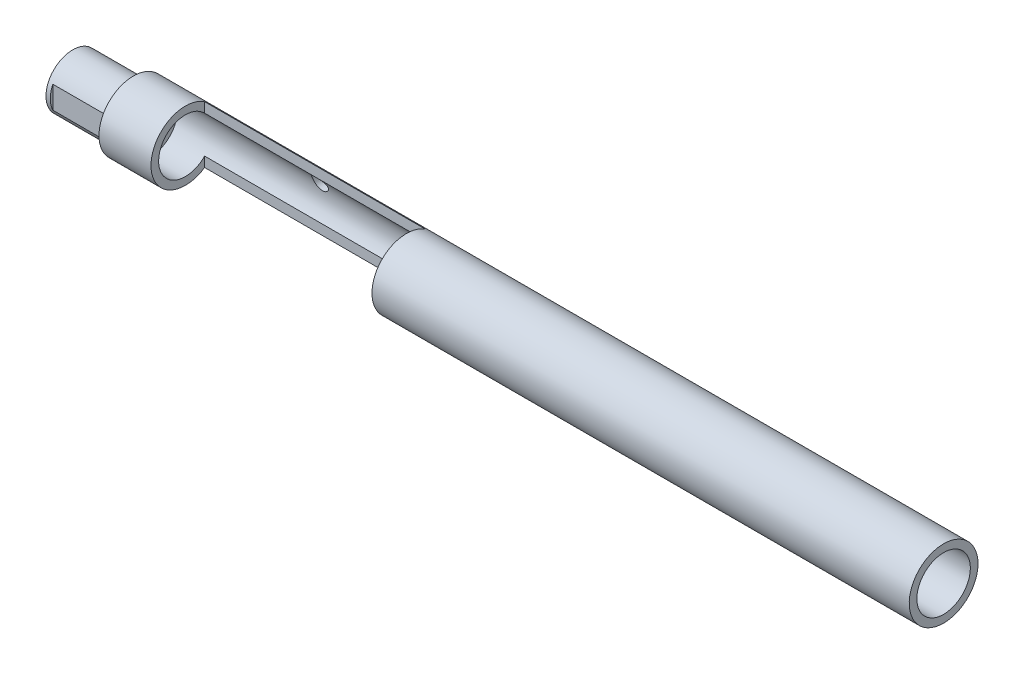
ISO-10303-21;
HEADER;
FILE_DESCRIPTION(('STEP AP214'),'2;1');
FILE_NAME('part.step','',(''),(''),'','','');
FILE_SCHEMA(('AUTOMOTIVE_DESIGN { 1 0 10303 214 1 1 1 1 }'));
ENDSEC;
DATA;
#1=APPLICATION_CONTEXT('core data for automotive mechanical design processes');
#2=APPLICATION_PROTOCOL_DEFINITION('international standard','automotive_design',2000,#1);
#3=PRODUCT_CONTEXT('',#1,'mechanical');
#4=PRODUCT('Part','Part','',(#3));
#5=PRODUCT_RELATED_PRODUCT_CATEGORY('part','',(#4));
#6=PRODUCT_DEFINITION_FORMATION('','',#4);
#7=PRODUCT_DEFINITION_CONTEXT('part definition',#1,'design');
#8=PRODUCT_DEFINITION('design','',#6,#7);
#9=PRODUCT_DEFINITION_SHAPE('','',#8);
#10=(LENGTH_UNIT() NAMED_UNIT(*) SI_UNIT(.MILLI.,.METRE.));
#11=(NAMED_UNIT(*) PLANE_ANGLE_UNIT() SI_UNIT($,.RADIAN.));
#12=(NAMED_UNIT(*) SI_UNIT($,.STERADIAN.) SOLID_ANGLE_UNIT());
#13=UNCERTAINTY_MEASURE_WITH_UNIT(LENGTH_MEASURE(1.E-05),#10,'distance_accuracy_value','');
#14=(GEOMETRIC_REPRESENTATION_CONTEXT(3) GLOBAL_UNCERTAINTY_ASSIGNED_CONTEXT((#13)) GLOBAL_UNIT_ASSIGNED_CONTEXT((#10,
#11,#12)) REPRESENTATION_CONTEXT('',''));
#15=CARTESIAN_POINT('',(0.,0.,0.));
#16=DIRECTION('',(0.,0.,1.));
#17=DIRECTION('',(1.,0.,0.));
#18=AXIS2_PLACEMENT_3D('',#15,#16,#17);
#19=CARTESIAN_POINT('',(8.5,0.,0.));
#20=DIRECTION('',(-1.,0.,0.));
#21=DIRECTION('',(0.,-1.,0.));
#22=AXIS2_PLACEMENT_3D('',#19,#20,#21);
#23=CYLINDRICAL_SURFACE('',#22,3.0861);
#24=CARTESIAN_POINT('',(-0.500000000000002,0.,0.));
#25=DIRECTION('',(-1.,0.,0.));
#26=DIRECTION('',(0.,-1.,0.));
#27=AXIS2_PLACEMENT_3D('',#24,#25,#26);
#28=CIRCLE('',#27,3.0861);
#29=CARTESIAN_POINT('',(-0.500000000000002,-3.0861,0.));
#30=VERTEX_POINT('',#29);
#31=EDGE_CURVE('E148',#30,#30,#28,.T.);
#32=ORIENTED_EDGE('',*,*,#31,.F.);
#33=EDGE_LOOP('',(#32));
#34=FACE_BOUND('',#33,.T.);
#35=CARTESIAN_POINT('',(0.,0.,0.));
#36=DIRECTION('',(-1.,0.,0.));
#37=DIRECTION('',(0.,0.,1.));
#38=AXIS2_PLACEMENT_3D('',#35,#36,#37);
#39=CIRCLE('',#38,3.0861);
#40=CARTESIAN_POINT('',(0.,1.29769534560312,2.8));
#41=VERTEX_POINT('',#40);
#42=CARTESIAN_POINT('',(0.,-1.29769534560312,2.8));
#43=VERTEX_POINT('',#42);
#44=EDGE_CURVE('E11',#41,#43,#39,.F.);
#45=ORIENTED_EDGE('',*,*,#44,.F.);
#46=DIRECTION('',(-1.,0.,0.));
#47=VECTOR('',#46,1.);
#48=CARTESIAN_POINT('',(8.5,1.29769534560312,2.8));
#49=LINE('',#48,#47);
#50=CARTESIAN_POINT('',(6.5,1.29769534560312,2.8));
#51=VERTEX_POINT('',#50);
#52=EDGE_CURVE('E101',#41,#51,#49,.F.);
#53=ORIENTED_EDGE('',*,*,#52,.T.);
#54=CARTESIAN_POINT('',(6.49999999999999,0.,0.));
#55=DIRECTION('',(-1.,0.,0.));
#56=DIRECTION('',(0.,-1.,0.));
#57=AXIS2_PLACEMENT_3D('',#54,#55,#56);
#58=CIRCLE('',#57,3.0861);
#59=CARTESIAN_POINT('',(6.49999999999999,1.29769534560312,-2.8));
#60=VERTEX_POINT('',#59);
#61=EDGE_CURVE('E57',#51,#60,#58,.T.);
#62=ORIENTED_EDGE('',*,*,#61,.T.);
#63=DIRECTION('',(-1.,0.,0.));
#64=VECTOR('',#63,1.);
#65=CARTESIAN_POINT('',(8.5,1.29769534560312,-2.8));
#66=LINE('',#65,#64);
#67=CARTESIAN_POINT('',(0.,1.29769534560312,-2.8));
#68=VERTEX_POINT('',#67);
#69=EDGE_CURVE('E130',#60,#68,#66,.T.);
#70=ORIENTED_EDGE('',*,*,#69,.T.);
#71=CARTESIAN_POINT('',(0.,0.,0.));
#72=DIRECTION('',(1.,0.,0.));
#73=DIRECTION('',(0.,0.,-1.));
#74=AXIS2_PLACEMENT_3D('',#71,#72,#73);
#75=CIRCLE('',#74,3.0861);
#76=CARTESIAN_POINT('',(0.,-1.29769534560312,-2.8));
#77=VERTEX_POINT('',#76);
#78=EDGE_CURVE('E132',#68,#77,#75,.F.);
#79=ORIENTED_EDGE('',*,*,#78,.T.);
#80=DIRECTION('',(-1.,0.,0.));
#81=VECTOR('',#80,1.);
#82=CARTESIAN_POINT('',(8.5,-1.29769534560312,-2.8));
#83=LINE('',#82,#81);
#84=CARTESIAN_POINT('',(6.5,-1.29769534560312,-2.8));
#85=VERTEX_POINT('',#84);
#86=EDGE_CURVE('E43',#77,#85,#83,.F.);
#87=ORIENTED_EDGE('',*,*,#86,.T.);
#88=CARTESIAN_POINT('',(6.49999999999999,-1.29769534560312,2.8));
#89=VERTEX_POINT('',#88);
#90=EDGE_CURVE('E115',#85,#89,#58,.T.);
#91=ORIENTED_EDGE('',*,*,#90,.T.);
#92=DIRECTION('',(-1.,0.,0.));
#93=VECTOR('',#92,1.);
#94=CARTESIAN_POINT('',(8.5,-1.29769534560312,2.8));
#95=LINE('',#94,#93);
#96=EDGE_CURVE('E104',#89,#43,#95,.T.);
#97=ORIENTED_EDGE('',*,*,#96,.T.);
#98=EDGE_LOOP('',(#45,#53,#62,#70,#79,#87,#91,#97));
#99=FACE_BOUND('',#98,.T.);
#100=ADVANCED_FACE('F34',(#34,#99),#23,.T.);
#101=CARTESIAN_POINT('',(100.,0.,0.));
#102=DIRECTION('',(-1.,0.,0.));
#103=DIRECTION('',(0.,0.,1.));
#104=AXIS2_PLACEMENT_3D('',#101,#102,#103);
#105=CYLINDRICAL_SURFACE('',#104,3.0861);
#106=CARTESIAN_POINT('',(26.139,1.23864704437437,-2.82661753858965));
#107=CARTESIAN_POINT('',(26.1389979221239,1.29458280832677,-2.80210310981899));
#108=CARTESIAN_POINT('',(26.1337066583626,1.34981800283777,-2.77590029551436));
#109=CARTESIAN_POINT('',(26.1134443101461,1.45724499141713,-2.72104888023321));
#110=CARTESIAN_POINT('',(26.0984574721891,1.50943168150697,-2.69239636481923));
#111=CARTESIAN_POINT('',(26.0597876975244,1.60935053775347,-2.63388286137032));
#112=CARTESIAN_POINT('',(26.0361469066913,1.65710290976364,-2.60402834411155));
#113=CARTESIAN_POINT('',(25.9807985860438,1.74763949402386,-2.54415405575985));
#114=CARTESIAN_POINT('',(25.9490830622156,1.7904187213524,-2.51413414991471));
#115=CARTESIAN_POINT('',(25.8752237787143,1.87326209263243,-2.45310954398513));
#116=CARTESIAN_POINT('',(25.8324605052814,1.91285578399153,-2.42221004403922));
#117=CARTESIAN_POINT('',(25.7383094593259,1.98385218703375,-2.36440879066039));
#118=CARTESIAN_POINT('',(25.6869458185547,2.01527720635368,-2.33749623779895));
#119=CARTESIAN_POINT('',(25.5969684043155,2.05803959646891,-2.29977731759919));
#120=CARTESIAN_POINT('',(25.5607765711467,2.07249336153415,-2.28671257523293));
#121=CARTESIAN_POINT('',(25.485722315011,2.09672950226568,-2.26451072747757));
#122=CARTESIAN_POINT('',(25.4468635891735,2.1065182012548,-2.25536830721527));
#123=CARTESIAN_POINT('',(25.3670222701809,2.12085009434559,-2.24189866312721));
#124=CARTESIAN_POINT('',(25.3260254012715,2.12535151527785,-2.2376097953155));
#125=CARTESIAN_POINT('',(25.2435992113383,2.12857883757491,-2.23454062612591));
#126=CARTESIAN_POINT('',(25.2021700501053,2.12730680248057,-2.23575835658652));
#127=CARTESIAN_POINT('',(25.1249635712331,2.11956944834808,-2.24309153641911));
#128=CARTESIAN_POINT('',(25.0890691858277,2.11369600651705,-2.24864857134194));
#129=CARTESIAN_POINT('',(25.0189873054108,2.09785996786375,-2.26342956562696));
#130=CARTESIAN_POINT('',(24.9848007790642,2.08789507933525,-2.27265557997128));
#131=CARTESIAN_POINT('',(24.907315364413,2.06029894585346,-2.29774562402788));
#132=CARTESIAN_POINT('',(24.8649231475008,2.04120991508057,-2.31480127641995));
#133=CARTESIAN_POINT('',(24.7847983877494,1.99759324066523,-2.35254506966085));
#134=CARTESIAN_POINT('',(24.7470758156217,1.97305426183934,-2.37324076237636));
#135=CARTESIAN_POINT('',(24.6669656664349,1.91211823448946,-2.42275463919354));
#136=CARTESIAN_POINT('',(24.6260751096695,1.87430898748006,-2.45225589529317));
#137=CARTESIAN_POINT('',(24.5524153065254,1.79247929152146,-2.51269290413959));
#138=CARTESIAN_POINT('',(24.5196502903581,1.74845562593955,-2.54362939417225));
#139=CARTESIAN_POINT('',(24.4624193126459,1.65467402315481,-2.60561925294468));
#140=CARTESIAN_POINT('',(24.4380275647771,1.60486979232102,-2.63667131910524));
#141=CARTESIAN_POINT('',(24.3987115715341,1.50079305824452,-2.69726822884146));
#142=CARTESIAN_POINT('',(24.3837849208011,1.44652169419543,-2.72681345359323));
#143=CARTESIAN_POINT('',(24.3642956676612,1.33419067570119,-2.78351247667897));
#144=CARTESIAN_POINT('',(24.3598395110023,1.27609823363642,-2.81063903870698));
#145=CARTESIAN_POINT('',(24.3626719750535,1.15855073545402,-2.86109237776345));
#146=CARTESIAN_POINT('',(24.3699498293819,1.09909697772379,-2.884422616438));
#147=CARTESIAN_POINT('',(24.395261857699,0.988522693065581,-2.92401531441899));
#148=CARTESIAN_POINT('',(24.4118891521964,0.937263732473683,-2.94079126158605));
#149=CARTESIAN_POINT('',(24.4546841297361,0.837747531664416,-2.97067115157264));
#150=CARTESIAN_POINT('',(24.480845409921,0.78948830228222,-2.98377754837643));
#151=CARTESIAN_POINT('',(24.5390055837157,0.702680138096119,-3.00533812134331));
#152=CARTESIAN_POINT('',(24.5701556163074,0.663642752512299,-3.0141270935502));
#153=CARTESIAN_POINT('',(24.6388516740641,0.591104067478317,-3.02918849153996));
#154=CARTESIAN_POINT('',(24.6763965678414,0.557601790810931,-3.0354613618176));
#155=CARTESIAN_POINT('',(24.7556060163189,0.498190423562052,-3.04576846533859));
#156=CARTESIAN_POINT('',(24.7971182334504,0.472088149476647,-3.04986272753462));
#157=CARTESIAN_POINT('',(24.8839655567407,0.427023363866837,-3.05649881838806));
#158=CARTESIAN_POINT('',(24.9293006840615,0.408060891868829,-3.05904063845111));
#159=CARTESIAN_POINT('',(25.0227733454238,0.377766021751644,-3.06293036187873));
#160=CARTESIAN_POINT('',(25.0709247879319,0.366475709383964,-3.06427169246765));
#161=CARTESIAN_POINT('',(25.1684503350705,0.352023714400158,-3.06596577609428));
#162=CARTESIAN_POINT('',(25.2178244925666,0.34886238387322,-3.06631848631209));
#163=CARTESIAN_POINT('',(25.3167278046073,0.350767440847995,-3.06610117885133));
#164=CARTESIAN_POINT('',(25.3662559433001,0.355886362525716,-3.0655252696073));
#165=CARTESIAN_POINT('',(25.4637457251328,0.374300717814206,-3.06333104053622));
#166=CARTESIAN_POINT('',(25.5117073452798,0.387596271381994,-3.06171270541602));
#167=CARTESIAN_POINT('',(25.6046888874318,0.421962921054745,-3.05716519452194));
#168=CARTESIAN_POINT('',(25.6497091252026,0.443033180902633,-3.05423615972134));
#169=CARTESIAN_POINT('',(25.7355119823845,0.492292169258268,-3.0466833885228));
#170=CARTESIAN_POINT('',(25.776294982589,0.520480257316427,-3.04205980458052));
#171=CARTESIAN_POINT('',(25.8521930986542,0.582841938025722,-3.03072646388128));
#172=CARTESIAN_POINT('',(25.8873448132665,0.616973596885459,-3.02403108291651));
#173=CARTESIAN_POINT('',(25.9513519036569,0.690202933617114,-3.00816108586099));
#174=CARTESIAN_POINT('',(25.9802073060621,0.729300590486787,-2.99898648025523));
#175=CARTESIAN_POINT('',(26.0308099929843,0.810917852954029,-2.97795086608322));
#176=CARTESIAN_POINT('',(26.052590312231,0.853420365321044,-2.96610279336878));
#177=CARTESIAN_POINT('',(26.0888701486125,0.940579088960703,-2.93962483369172));
#178=CARTESIAN_POINT('',(26.1033733575164,0.985234195566588,-2.92499636246421));
#179=CARTESIAN_POINT('',(26.1225842583815,1.06489769502337,-2.89678441048335));
#180=CARTESIAN_POINT('',(26.1287813433951,1.09974973831967,-2.88374111445281));
#181=CARTESIAN_POINT('',(26.1369900001865,1.16937239654081,-2.85621860469207));
#182=CARTESIAN_POINT('',(26.1390012817402,1.20414300565243,-2.84173929146799));
#183=CARTESIAN_POINT('',(26.139,1.23864704437437,-2.82661753858965));
#184=B_SPLINE_CURVE_WITH_KNOTS('',3,(#106,#107,#108,#109,#110,#111,#112,#113,#114,#115,#116,
#117,#118,#119,#120,#121,#122,#123,#124,#125,#126,#127,#128,#129,#130,#131,#132,#133,#134,#135,
#136,#137,#138,#139,#140,#141,#142,#143,#144,#145,#146,#147,#148,#149,#150,#151,#152,#153,#154,
#155,#156,#157,#158,#159,#160,#161,#162,#163,#164,#165,#166,#167,#168,#169,#170,#171,#172,#173,
#174,#175,#176,#177,#178,#179,#180,#181,#182,#183),.UNSPECIFIED.,.T.,.F.,(4,2,2,2,2,2,2,2,2,2,2,
2,2,2,2,2,2,2,2,2,2,2,2,2,2,2,2,2,2,2,2,2,2,2,2,2,2,2,4),(0.,0.183065465051399,0.36642912698099,
0.548911413235336,0.731575064883596,0.928455469516105,1.12479243133961,1.24765464593094,
1.37034984836032,1.49400804341821,1.61762204421227,1.72752053599888,1.83748066842374,
1.98523521752791,2.13330000373097,2.32140440624443,2.50960653256905,2.6994360828163,
2.88921737245417,3.080919833679,3.2724465010037,3.44081665421692,3.6090739407409,
3.7604525390151,3.91180438294362,4.05873600515982,4.20566844078688,4.35340050727101,
4.50113897234084,4.64981844807863,4.79850010510236,4.94716577440176,5.09581807179085,
5.24346119214454,5.39110368810532,5.53804656250749,5.68491481539043,5.79783112396847,
5.91075526138007),.UNSPECIFIED.);
#185=CARTESIAN_POINT('',(26.139,1.23864704437437,-2.82661753858965));
#186=VERTEX_POINT('',#185);
#187=EDGE_CURVE('E124',#186,#186,#184,.T.);
#188=ORIENTED_EDGE('',*,*,#187,.F.);
#189=EDGE_LOOP('',(#188));
#190=FACE_BOUND('',#189,.T.);
#191=CARTESIAN_POINT('',(12.5,0.,0.));
#192=DIRECTION('',(-1.,0.,0.));
#193=DIRECTION('',(0.,0.,1.));
#194=AXIS2_PLACEMENT_3D('',#191,#192,#193);
#195=CIRCLE('',#194,3.0861);
#196=CARTESIAN_POINT('',(12.5,-2.14503185232761,-2.21875));
#197=VERTEX_POINT('',#196);
#198=CARTESIAN_POINT('',(12.5,2.14503185232761,-2.21875));
#199=VERTEX_POINT('',#198);
#200=EDGE_CURVE('E133',#197,#199,#195,.T.);
#201=ORIENTED_EDGE('',*,*,#200,.F.);
#202=DIRECTION('',(-1.,0.,0.));
#203=VECTOR('',#202,1.);
#204=CARTESIAN_POINT('',(100.,-2.14503185232761,-2.21875));
#205=LINE('',#204,#203);
#206=CARTESIAN_POINT('',(38.,-2.14503185232761,-2.21875));
#207=VERTEX_POINT('',#206);
#208=EDGE_CURVE('E346',#207,#197,#205,.T.);
#209=ORIENTED_EDGE('',*,*,#208,.F.);
#210=CARTESIAN_POINT('',(38.,0.,0.));
#211=DIRECTION('',(1.,0.,0.));
#212=DIRECTION('',(0.,0.,-1.));
#213=AXIS2_PLACEMENT_3D('',#210,#211,#212);
#214=CIRCLE('',#213,3.0861);
#215=CARTESIAN_POINT('',(38.,2.14503185232761,-2.21875));
#216=VERTEX_POINT('',#215);
#217=EDGE_CURVE('E345',#216,#207,#214,.T.);
#218=ORIENTED_EDGE('',*,*,#217,.F.);
#219=DIRECTION('',(-1.,0.,0.));
#220=VECTOR('',#219,1.);
#221=CARTESIAN_POINT('',(100.,2.14503185232761,-2.21875));
#222=LINE('',#221,#220);
#223=EDGE_CURVE('E335',#199,#216,#222,.F.);
#224=ORIENTED_EDGE('',*,*,#223,.F.);
#225=EDGE_LOOP('',(#201,#209,#218,#224));
#226=FACE_BOUND('',#225,.T.);
#227=CARTESIAN_POINT('',(100.,0.,0.));
#228=DIRECTION('',(1.,0.,0.));
#229=DIRECTION('',(0.,0.,-1.));
#230=AXIS2_PLACEMENT_3D('',#227,#228,#229);
#231=CIRCLE('',#230,3.0861);
#232=CARTESIAN_POINT('',(100.,0.,-3.0861));
#233=VERTEX_POINT('',#232);
#234=EDGE_CURVE('E366',#233,#233,#231,.T.);
#235=ORIENTED_EDGE('',*,*,#234,.T.);
#236=EDGE_LOOP('',(#235));
#237=FACE_BOUND('',#236,.T.);
#238=CARTESIAN_POINT('',(8.5,0.,0.));
#239=DIRECTION('',(-1.,0.,0.));
#240=DIRECTION('',(0.,-1.,0.));
#241=AXIS2_PLACEMENT_3D('',#238,#239,#240);
#242=CIRCLE('',#241,3.0861);
#243=CARTESIAN_POINT('',(8.5,-3.0861,0.));
#244=VERTEX_POINT('',#243);
#245=EDGE_CURVE('E116',#244,#244,#242,.T.);
#246=ORIENTED_EDGE('',*,*,#245,.T.);
#247=EDGE_LOOP('',(#246));
#248=FACE_BOUND('',#247,.T.);
#249=ADVANCED_FACE('F184',(#190,#226,#237,#248),#105,.F.);
#250=CARTESIAN_POINT('',(100.,0.,0.));
#251=DIRECTION('',(-1.,0.,0.));
#252=DIRECTION('',(0.,0.,1.));
#253=AXIS2_PLACEMENT_3D('',#250,#251,#252);
#254=CYLINDRICAL_SURFACE('',#253,3.96875);
#255=CARTESIAN_POINT('',(100.,0.,0.));
#256=DIRECTION('',(1.,0.,0.));
#257=DIRECTION('',(0.,0.,-1.));
#258=AXIS2_PLACEMENT_3D('',#255,#256,#257);
#259=CIRCLE('',#258,3.96875);
#260=CARTESIAN_POINT('',(100.,0.,-3.96875));
#261=VERTEX_POINT('',#260);
#262=EDGE_CURVE('E349',#261,#261,#259,.T.);
#263=ORIENTED_EDGE('',*,*,#262,.F.);
#264=EDGE_LOOP('',(#263));
#265=FACE_BOUND('',#264,.T.);
#266=CARTESIAN_POINT('',(12.5,0.,0.));
#267=DIRECTION('',(-1.,0.,0.));
#268=DIRECTION('',(0.,0.,1.));
#269=AXIS2_PLACEMENT_3D('',#266,#267,#268);
#270=CIRCLE('',#269,3.96875);
#271=CARTESIAN_POINT('',(12.5,-3.29061164527205,-2.21875));
#272=VERTEX_POINT('',#271);
#273=CARTESIAN_POINT('',(12.5,3.29061164527205,-2.21875));
#274=VERTEX_POINT('',#273);
#275=EDGE_CURVE('E354',#272,#274,#270,.T.);
#276=ORIENTED_EDGE('',*,*,#275,.T.);
#277=DIRECTION('',(-1.,0.,0.));
#278=VECTOR('',#277,1.);
#279=CARTESIAN_POINT('',(100.,3.29061164527205,-2.21875));
#280=LINE('',#279,#278);
#281=CARTESIAN_POINT('',(38.,3.29061164527205,-2.21875));
#282=VERTEX_POINT('',#281);
#283=EDGE_CURVE('E338',#274,#282,#280,.F.);
#284=ORIENTED_EDGE('',*,*,#283,.T.);
#285=CARTESIAN_POINT('',(38.,0.,0.));
#286=DIRECTION('',(1.,0.,0.));
#287=DIRECTION('',(0.,0.,-1.));
#288=AXIS2_PLACEMENT_3D('',#285,#286,#287);
#289=CIRCLE('',#288,3.96875);
#290=CARTESIAN_POINT('',(38.,-3.29061164527205,-2.21875));
#291=VERTEX_POINT('',#290);
#292=EDGE_CURVE('E357',#282,#291,#289,.T.);
#293=ORIENTED_EDGE('',*,*,#292,.T.);
#294=DIRECTION('',(-1.,0.,0.));
#295=VECTOR('',#294,1.);
#296=CARTESIAN_POINT('',(100.,-3.29061164527205,-2.21875));
#297=LINE('',#296,#295);
#298=EDGE_CURVE('E361',#291,#272,#297,.T.);
#299=ORIENTED_EDGE('',*,*,#298,.T.);
#300=EDGE_LOOP('',(#276,#284,#293,#299));
#301=FACE_BOUND('',#300,.T.);
#302=CARTESIAN_POINT('',(26.139,1.23864704437437,-3.77050793156076));
#303=CARTESIAN_POINT('',(26.1389977752082,1.29212761004894,-3.75293720169041));
#304=CARTESIAN_POINT('',(26.1341594490679,1.34526743469516,-3.73420757731318));
#305=CARTESIAN_POINT('',(26.1153035721865,1.44930123961257,-3.6950785399997));
#306=CARTESIAN_POINT('',(26.1012715985361,1.5001915567487,-3.67467654753931));
#307=CARTESIAN_POINT('',(26.0646862143297,1.59828574719451,-3.63308266223128));
#308=CARTESIAN_POINT('',(26.0421548806517,1.64549879205317,-3.61189294293965));
#309=CARTESIAN_POINT('',(25.9891717171999,1.73530116323127,-3.56961789492325));
#310=CARTESIAN_POINT('',(25.9587196229156,1.77789033507115,-3.54853256970864));
#311=CARTESIAN_POINT('',(25.8893692434939,1.85868940688843,-3.50690477139787));
#312=CARTESIAN_POINT('',(25.8502313192049,1.89671496345097,-3.48640141958832));
#313=CARTESIAN_POINT('',(25.7648203577598,1.96547759105997,-3.44810468572081));
#314=CARTESIAN_POINT('',(25.7185491507124,1.99621652643669,-3.43031061089408));
#315=CARTESIAN_POINT('',(25.6232785658297,2.04716338331542,-3.4001351193378));
#316=CARTESIAN_POINT('',(25.5746810657714,2.06794696484625,-3.38746712646527));
#317=CARTESIAN_POINT('',(25.4736195060331,2.10069289627926,-3.36726069394778));
#318=CARTESIAN_POINT('',(25.4211622267686,2.11267032719604,-3.35971348639667));
#319=CARTESIAN_POINT('',(25.3224973586415,2.12586714005736,-3.35137501336979));
#320=CARTESIAN_POINT('',(25.2765384072882,2.12843509978858,-3.34973743373605));
#321=CARTESIAN_POINT('',(25.1848438330689,2.12643955543774,-3.35100490705298));
#322=CARTESIAN_POINT('',(25.1391081470588,2.1218782008294,-3.35390859082217));
#323=CARTESIAN_POINT('',(25.0527380727289,2.10651165845885,-3.36357803827567));
#324=CARTESIAN_POINT('',(25.0119785672643,2.09620126759964,-3.3700372843534));
#325=CARTESIAN_POINT('',(24.9328705069906,2.07020248307955,-3.38607002954067));
#326=CARTESIAN_POINT('',(24.8945224523021,2.05451297814727,-3.39564417213594));
#327=CARTESIAN_POINT('',(24.8182712810259,2.01702048617457,-3.41805698976926));
#328=CARTESIAN_POINT('',(24.780601108631,1.99485730348153,-3.4310817436733));
#329=CARTESIAN_POINT('',(24.7094018297169,1.9457173249257,-3.45918514868016));
#330=CARTESIAN_POINT('',(24.6758748161156,1.9187381129288,-3.47426482980838));
#331=CARTESIAN_POINT('',(24.6089349583423,1.85649011566694,-3.50796827521557));
#332=CARTESIAN_POINT('',(24.5762101720196,1.82058849840568,-3.52679155160466));
#333=CARTESIAN_POINT('',(24.5171538047084,1.74420690099485,-3.56518560663895));
#334=CARTESIAN_POINT('',(24.4908259000299,1.70372430763722,-3.5847568076777));
#335=CARTESIAN_POINT('',(24.4426815476287,1.61464592732311,-3.62581508974801));
#336=CARTESIAN_POINT('',(24.4216038597654,1.56564385320022,-3.64729298608567));
#337=CARTESIAN_POINT('',(24.3884460146076,1.46423739894048,-3.68917250131163));
#338=CARTESIAN_POINT('',(24.3763665750486,1.41183274776314,-3.7095740342244));
#339=CARTESIAN_POINT('',(24.3618470609081,1.30502930640136,-3.74847978916108));
#340=CARTESIAN_POINT('',(24.3594018655253,1.2506315910955,-3.76698501401611));
#341=CARTESIAN_POINT('',(24.3646378661002,1.14152067643811,-3.80147016410967));
#342=CARTESIAN_POINT('',(24.372314196496,1.0868076412504,-3.81745129858011));
#343=CARTESIAN_POINT('',(24.3970780505975,0.982693907705856,-3.84551699908352));
#344=CARTESIAN_POINT('',(24.4134925179259,0.933184477665446,-3.85779223852772));
#345=CARTESIAN_POINT('',(24.4550192834009,0.837335064486617,-3.87972459851047));
#346=CARTESIAN_POINT('',(24.4801285981585,0.790994000735998,-3.88938261505088));
#347=CARTESIAN_POINT('',(24.5367243780267,0.705704452305476,-3.90573161391657));
#348=CARTESIAN_POINT('',(24.5677630446999,0.666484536019376,-3.91256088649112));
#349=CARTESIAN_POINT('',(24.6361530798201,0.593661004718485,-3.92427134782044));
#350=CARTESIAN_POINT('',(24.6735037833091,0.560056798842822,-3.92915274159771));
#351=CARTESIAN_POINT('',(24.7527405834509,0.500080427748669,-3.93723241762801));
#352=CARTESIAN_POINT('',(24.7945362899065,0.473592426561704,-3.94045855118253));
#353=CARTESIAN_POINT('',(24.8820001395169,0.427887032246868,-3.94568379081876));
#354=CARTESIAN_POINT('',(24.9276683068908,0.40866968459506,-3.94768288922573));
#355=CARTESIAN_POINT('',(25.0217384928674,0.37802357789123,-3.95073593829115));
#356=CARTESIAN_POINT('',(25.0701487940511,0.366619945262366,-3.95178684326091));
#357=CARTESIAN_POINT('',(25.1682032156816,0.352031391476825,-3.95311331483543));
#358=CARTESIAN_POINT('',(25.217847368019,0.348846682973219,-3.9533888613789));
#359=CARTESIAN_POINT('',(25.3171640746146,0.350792142529266,-3.95321671648947));
#360=CARTESIAN_POINT('',(25.3668359968034,0.355954500967816,-3.9527662251205));
#361=CARTESIAN_POINT('',(25.4646056742101,0.374505188441482,-3.95105151664506));
#362=CARTESIAN_POINT('',(25.5127034140085,0.387893598027763,-3.94978729157033));
#363=CARTESIAN_POINT('',(25.6059513077327,0.422502072912728,-3.94623481495562));
#364=CARTESIAN_POINT('',(25.6511016338372,0.443721680254511,-3.94394662329402));
#365=CARTESIAN_POINT('',(25.7371611899376,0.493353866873879,-3.93804523622988));
#366=CARTESIAN_POINT('',(25.7780707136469,0.521765947538846,-3.93443213266803));
#367=CARTESIAN_POINT('',(25.8543211281656,0.584771868493984,-3.92556025627803));
#368=CARTESIAN_POINT('',(25.8896844466112,0.619339537693968,-3.92030838237404));
#369=CARTESIAN_POINT('',(25.9540691161621,0.693647734756462,-3.90784406077964));
#370=CARTESIAN_POINT('',(25.9830898886726,0.733388734025662,-3.90063143435532));
#371=CARTESIAN_POINT('',(26.0339753317829,0.816652893015614,-3.88405078291807));
#372=CARTESIAN_POINT('',(26.0558583408556,0.860165991012733,-3.87468838840841));
#373=CARTESIAN_POINT('',(26.0921071607486,0.949674946292686,-3.85372555258102));
#374=CARTESIAN_POINT('',(26.1064788331183,0.995668836647542,-3.84212686608227));
#375=CARTESIAN_POINT('',(26.1243857119985,1.07468855645873,-3.82062291610313));
#376=CARTESIAN_POINT('',(26.1298828568027,1.10743536637928,-3.81126428169526));
#377=CARTESIAN_POINT('',(26.1371906823218,1.17304635644425,-3.79158448451764));
#378=CARTESIAN_POINT('',(26.1390013618389,1.2059105366268,-3.78126332143512));
#379=CARTESIAN_POINT('',(26.139,1.23864704437437,-3.77050793156076));
#380=B_SPLINE_CURVE_WITH_KNOTS('',3,(#302,#303,#304,#305,#306,#307,#308,#309,#310,#311,#312,
#313,#314,#315,#316,#317,#318,#319,#320,#321,#322,#323,#324,#325,#326,#327,#328,#329,#330,#331,
#332,#333,#334,#335,#336,#337,#338,#339,#340,#341,#342,#343,#344,#345,#346,#347,#348,#349,#350,
#351,#352,#353,#354,#355,#356,#357,#358,#359,#360,#361,#362,#363,#364,#365,#366,#367,#368,#369,
#370,#371,#372,#373,#374,#375,#376,#377,#378,#379),.UNSPECIFIED.,.T.,.F.,(4,2,2,2,2,2,2,2,2,2,2,
2,2,2,2,2,2,2,2,2,2,2,2,2,2,2,2,2,2,2,2,2,2,2,2,2,2,2,4),(0.,0.16874647067938,0.337758305180303,
0.506334125172208,0.674915575403605,0.848905752223037,1.02285136433924,1.18492238169483,
1.34671519291183,1.48414046682346,1.62152431528731,1.74858748524422,1.87567692102017,
2.01196168384872,2.14831501196895,2.30397109018962,2.45971641401651,2.631421357481,
2.80313999533691,2.97476734883737,3.14631222869047,3.3062314436823,3.46609584123637,
3.6168009319412,3.76749015610819,3.91555310026259,4.06361697049718,4.21215476028733,
4.3606963932448,4.50981224304845,4.65892955304808,4.80803814426861,4.95713640148145,
5.10561526295083,5.25410766366618,5.40221549358395,5.55020757280183,5.65350057802784,
5.75679361681854),.UNSPECIFIED.);
#381=CARTESIAN_POINT('',(26.139,1.23864704437437,-3.77050793156076));
#382=VERTEX_POINT('',#381);
#383=EDGE_CURVE('E155',#382,#382,#380,.T.);
#384=ORIENTED_EDGE('',*,*,#383,.T.);
#385=EDGE_LOOP('',(#384));
#386=FACE_BOUND('',#385,.T.);
#387=CARTESIAN_POINT('',(6.49999999999999,0.,0.));
#388=DIRECTION('',(-1.,0.,0.));
#389=DIRECTION('',(0.,-1.,0.));
#390=AXIS2_PLACEMENT_3D('',#387,#388,#389);
#391=CIRCLE('',#390,3.96875);
#392=CARTESIAN_POINT('',(6.49999999999999,-3.96875,0.));
#393=VERTEX_POINT('',#392);
#394=EDGE_CURVE('E118',#393,#393,#391,.T.);
#395=ORIENTED_EDGE('',*,*,#394,.F.);
#396=EDGE_LOOP('',(#395));
#397=FACE_BOUND('',#396,.T.);
#398=ADVANCED_FACE('F36',(#265,#301,#386,#397),#254,.T.);
#399=CARTESIAN_POINT('',(100.,0.,0.));
#400=DIRECTION('',(1.,0.,0.));
#401=DIRECTION('',(0.,0.,-1.));
#402=AXIS2_PLACEMENT_3D('',#399,#400,#401);
#403=PLANE('',#402);
#404=ORIENTED_EDGE('',*,*,#262,.T.);
#405=EDGE_LOOP('',(#404));
#406=FACE_BOUND('',#405,.T.);
#407=ORIENTED_EDGE('',*,*,#234,.F.);
#408=EDGE_LOOP('',(#407));
#409=FACE_BOUND('',#408,.T.);
#410=ADVANCED_FACE('F182',(#406,#409),#403,.T.);
#411=CARTESIAN_POINT('',(12.5,-3.96875004792233,-2.21875));
#412=DIRECTION('',(-1.,0.,0.));
#413=DIRECTION('',(0.,0.,1.));
#414=AXIS2_PLACEMENT_3D('',#411,#412,#413);
#415=PLANE('',#414);
#416=ORIENTED_EDGE('',*,*,#275,.F.);
#417=DIRECTION('',(0.,1.,0.));
#418=VECTOR('',#417,1.);
#419=CARTESIAN_POINT('',(12.5,-3.96875004792233,-2.21875));
#420=LINE('',#419,#418);
#421=EDGE_CURVE('E339',#272,#197,#420,.T.);
#422=ORIENTED_EDGE('',*,*,#421,.T.);
#423=ORIENTED_EDGE('',*,*,#200,.T.);
#424=EDGE_CURVE('E161',#199,#274,#420,.T.);
#425=ORIENTED_EDGE('',*,*,#424,.T.);
#426=EDGE_LOOP('',(#416,#422,#423,#425));
#427=FACE_BOUND('',#426,.T.);
#428=ADVANCED_FACE('F176',(#427),#415,.F.);
#429=CARTESIAN_POINT('',(12.5,-3.96875004792233,-2.21875));
#430=DIRECTION('',(0.,0.,-1.));
#431=DIRECTION('',(-1.,0.,0.));
#432=AXIS2_PLACEMENT_3D('',#429,#430,#431);
#433=PLANE('',#432);
#434=DIRECTION('',(0.,1.,0.));
#435=VECTOR('',#434,1.);
#436=CARTESIAN_POINT('',(38.,-3.96875004792233,-2.21875));
#437=LINE('',#436,#435);
#438=EDGE_CURVE('E340',#291,#207,#437,.T.);
#439=ORIENTED_EDGE('',*,*,#438,.T.);
#440=ORIENTED_EDGE('',*,*,#208,.T.);
#441=ORIENTED_EDGE('',*,*,#421,.F.);
#442=ORIENTED_EDGE('',*,*,#298,.F.);
#443=EDGE_LOOP('',(#439,#440,#441,#442));
#444=FACE_BOUND('',#443,.T.);
#445=ADVANCED_FACE('F171',(#444),#433,.F.);
#446=ORIENTED_EDGE('',*,*,#424,.F.);
#447=ORIENTED_EDGE('',*,*,#223,.T.);
#448=EDGE_CURVE('E160',#216,#282,#437,.T.);
#449=ORIENTED_EDGE('',*,*,#448,.T.);
#450=ORIENTED_EDGE('',*,*,#283,.F.);
#451=EDGE_LOOP('',(#446,#447,#449,#450));
#452=FACE_BOUND('',#451,.T.);
#453=ADVANCED_FACE('F175',(#452),#433,.F.);
#454=CARTESIAN_POINT('',(38.,-3.96875004792233,-2.21875));
#455=DIRECTION('',(1.,0.,0.));
#456=DIRECTION('',(0.,0.,-1.));
#457=AXIS2_PLACEMENT_3D('',#454,#455,#456);
#458=PLANE('',#457);
#459=ORIENTED_EDGE('',*,*,#448,.F.);
#460=ORIENTED_EDGE('',*,*,#217,.T.);
#461=ORIENTED_EDGE('',*,*,#438,.F.);
#462=ORIENTED_EDGE('',*,*,#292,.F.);
#463=EDGE_LOOP('',(#459,#460,#461,#462));
#464=FACE_BOUND('',#463,.T.);
#465=ADVANCED_FACE('F168',(#464),#458,.F.);
#466=CARTESIAN_POINT('',(25.25,1.23864704437437,-2.21875));
#467=DIRECTION('',(0.,0.,1.));
#468=DIRECTION('',(1.,0.,0.));
#469=AXIS2_PLACEMENT_3D('',#466,#467,#468);
#470=CYLINDRICAL_SURFACE('',#469,0.888999999999994);
#471=ORIENTED_EDGE('',*,*,#187,.T.);
#472=EDGE_LOOP('',(#471));
#473=FACE_BOUND('',#472,.T.);
#474=ORIENTED_EDGE('',*,*,#383,.F.);
#475=EDGE_LOOP('',(#474));
#476=FACE_BOUND('',#475,.T.);
#477=ADVANCED_FACE('F163',(#473,#476),#470,.F.);
#478=CARTESIAN_POINT('',(6.5,8.87028604608986,10.));
#479=DIRECTION('',(-1.,0.,0.));
#480=DIRECTION('',(0.,-1.,0.));
#481=AXIS2_PLACEMENT_3D('',#478,#479,#480);
#482=PLANE('',#481);
#483=ORIENTED_EDGE('',*,*,#61,.F.);
#484=DIRECTION('',(0.,-1.,0.));
#485=VECTOR('',#484,1.);
#486=CARTESIAN_POINT('',(6.5,4.6827112054828,2.8));
#487=LINE('',#486,#485);
#488=EDGE_CURVE('E50',#51,#89,#487,.T.);
#489=ORIENTED_EDGE('',*,*,#488,.T.);
#490=ORIENTED_EDGE('',*,*,#90,.F.);
#491=DIRECTION('',(0.,1.,0.));
#492=VECTOR('',#491,1.);
#493=CARTESIAN_POINT('',(6.5,3.66932783101959,-2.8));
#494=LINE('',#493,#492);
#495=EDGE_CURVE('E113',#85,#60,#494,.T.);
#496=ORIENTED_EDGE('',*,*,#495,.T.);
#497=EDGE_LOOP('',(#483,#489,#490,#496));
#498=FACE_BOUND('',#497,.T.);
#499=ORIENTED_EDGE('',*,*,#394,.T.);
#500=EDGE_LOOP('',(#499));
#501=FACE_BOUND('',#500,.T.);
#502=ADVANCED_FACE('F111',(#498,#501),#482,.T.);
#503=CARTESIAN_POINT('',(8.5,0.,0.));
#504=DIRECTION('',(-1.,0.,0.));
#505=DIRECTION('',(0.,-1.,0.));
#506=AXIS2_PLACEMENT_3D('',#503,#504,#505);
#507=PLANE('',#506);
#508=CARTESIAN_POINT('',(8.5,0.,0.));
#509=DIRECTION('',(-1.,0.,0.));
#510=DIRECTION('',(0.,-1.,0.));
#511=AXIS2_PLACEMENT_3D('',#508,#509,#510);
#512=CIRCLE('',#511,2.0861);
#513=CARTESIAN_POINT('',(8.5,-2.0861,0.));
#514=VERTEX_POINT('',#513);
#515=EDGE_CURVE('E120',#514,#514,#512,.T.);
#516=ORIENTED_EDGE('',*,*,#515,.T.);
#517=EDGE_LOOP('',(#516));
#518=FACE_BOUND('',#517,.T.);
#519=ORIENTED_EDGE('',*,*,#245,.F.);
#520=EDGE_LOOP('',(#519));
#521=FACE_BOUND('',#520,.T.);
#522=ADVANCED_FACE('F203',(#518,#521),#507,.F.);
#523=CARTESIAN_POINT('',(8.5,0.,0.));
#524=DIRECTION('',(-1.,0.,0.));
#525=DIRECTION('',(0.,-1.,0.));
#526=AXIS2_PLACEMENT_3D('',#523,#524,#525);
#527=CYLINDRICAL_SURFACE('',#526,2.0861);
#528=ORIENTED_EDGE('',*,*,#515,.F.);
#529=EDGE_LOOP('',(#528));
#530=FACE_BOUND('',#529,.T.);
#531=CARTESIAN_POINT('',(-0.500000000000002,0.,0.));
#532=DIRECTION('',(-1.,0.,0.));
#533=DIRECTION('',(0.,-1.,0.));
#534=AXIS2_PLACEMENT_3D('',#531,#532,#533);
#535=CIRCLE('',#534,2.0861);
#536=CARTESIAN_POINT('',(-0.500000000000002,-2.0861,0.));
#537=VERTEX_POINT('',#536);
#538=EDGE_CURVE('E143',#537,#537,#535,.T.);
#539=ORIENTED_EDGE('',*,*,#538,.T.);
#540=EDGE_LOOP('',(#539));
#541=FACE_BOUND('',#540,.T.);
#542=ADVANCED_FACE('F206',(#530,#541),#527,.F.);
#543=CARTESIAN_POINT('',(-0.500000000000002,0.,0.));
#544=DIRECTION('',(-1.,0.,0.));
#545=DIRECTION('',(0.,-1.,0.));
#546=AXIS2_PLACEMENT_3D('',#543,#544,#545);
#547=PLANE('',#546);
#548=ORIENTED_EDGE('',*,*,#31,.T.);
#549=EDGE_LOOP('',(#548));
#550=FACE_BOUND('',#549,.T.);
#551=ORIENTED_EDGE('',*,*,#538,.F.);
#552=EDGE_LOOP('',(#551));
#553=FACE_BOUND('',#552,.T.);
#554=ADVANCED_FACE('F210',(#550,#553),#547,.T.);
#555=CARTESIAN_POINT('',(0.,0.,0.));
#556=DIRECTION('',(1.,0.,0.));
#557=DIRECTION('',(0.,0.,-1.));
#558=AXIS2_PLACEMENT_3D('',#555,#556,#557);
#559=PLANE('',#558);
#560=DIRECTION('',(0.,-1.,0.));
#561=VECTOR('',#560,1.);
#562=CARTESIAN_POINT('',(0.,3.66932783101959,-2.8));
#563=LINE('',#562,#561);
#564=EDGE_CURVE('E109',#68,#77,#563,.T.);
#565=ORIENTED_EDGE('',*,*,#564,.T.);
#566=ORIENTED_EDGE('',*,*,#78,.F.);
#567=EDGE_LOOP('',(#565,#566));
#568=FACE_BOUND('',#567,.T.);
#569=ADVANCED_FACE('F141',(#568),#559,.T.);
#570=CARTESIAN_POINT('',(16.8934826401745,3.66932783101959,-2.8));
#571=DIRECTION('',(0.,0.,-1.));
#572=DIRECTION('',(0.,1.,0.));
#573=AXIS2_PLACEMENT_3D('',#570,#571,#572);
#574=PLANE('',#573);
#575=ORIENTED_EDGE('',*,*,#564,.F.);
#576=ORIENTED_EDGE('',*,*,#69,.F.);
#577=ORIENTED_EDGE('',*,*,#495,.F.);
#578=ORIENTED_EDGE('',*,*,#86,.F.);
#579=EDGE_LOOP('',(#575,#576,#577,#578));
#580=FACE_BOUND('',#579,.T.);
#581=ADVANCED_FACE('F139',(#580),#574,.T.);
#582=CARTESIAN_POINT('',(0.,0.,0.));
#583=DIRECTION('',(-1.,0.,0.));
#584=DIRECTION('',(0.,0.,1.));
#585=AXIS2_PLACEMENT_3D('',#582,#583,#584);
#586=PLANE('',#585);
#587=ORIENTED_EDGE('',*,*,#44,.T.);
#588=DIRECTION('',(0.,1.,0.));
#589=VECTOR('',#588,1.);
#590=CARTESIAN_POINT('',(0.,4.6827112054828,2.8));
#591=LINE('',#590,#589);
#592=EDGE_CURVE('E106',#43,#41,#591,.T.);
#593=ORIENTED_EDGE('',*,*,#592,.T.);
#594=EDGE_LOOP('',(#587,#593));
#595=FACE_BOUND('',#594,.T.);
#596=ADVANCED_FACE('F217',(#595),#586,.F.);
#597=CARTESIAN_POINT('',(16.8934826401745,4.6827112054828,2.8));
#598=DIRECTION('',(0.,0.,1.));
#599=DIRECTION('',(0.,-1.,0.));
#600=AXIS2_PLACEMENT_3D('',#597,#598,#599);
#601=PLANE('',#600);
#602=ORIENTED_EDGE('',*,*,#592,.F.);
#603=ORIENTED_EDGE('',*,*,#96,.F.);
#604=ORIENTED_EDGE('',*,*,#488,.F.);
#605=ORIENTED_EDGE('',*,*,#52,.F.);
#606=EDGE_LOOP('',(#602,#603,#604,#605));
#607=FACE_BOUND('',#606,.T.);
#608=ADVANCED_FACE('F100',(#607),#601,.T.);
#609=CLOSED_SHELL('',(#100,#249,#398,#410,#428,#445,#453,#465,#477,#502,#522,#542,#554,#569,
#581,#596,#608));
#610=MANIFOLD_SOLID_BREP('B2',#609);
#611=ADVANCED_BREP_SHAPE_REPRESENTATION('',(#18,#610),#14);
#612=SHAPE_DEFINITION_REPRESENTATION(#9,#611);
ENDSEC;
END-ISO-10303-21;
